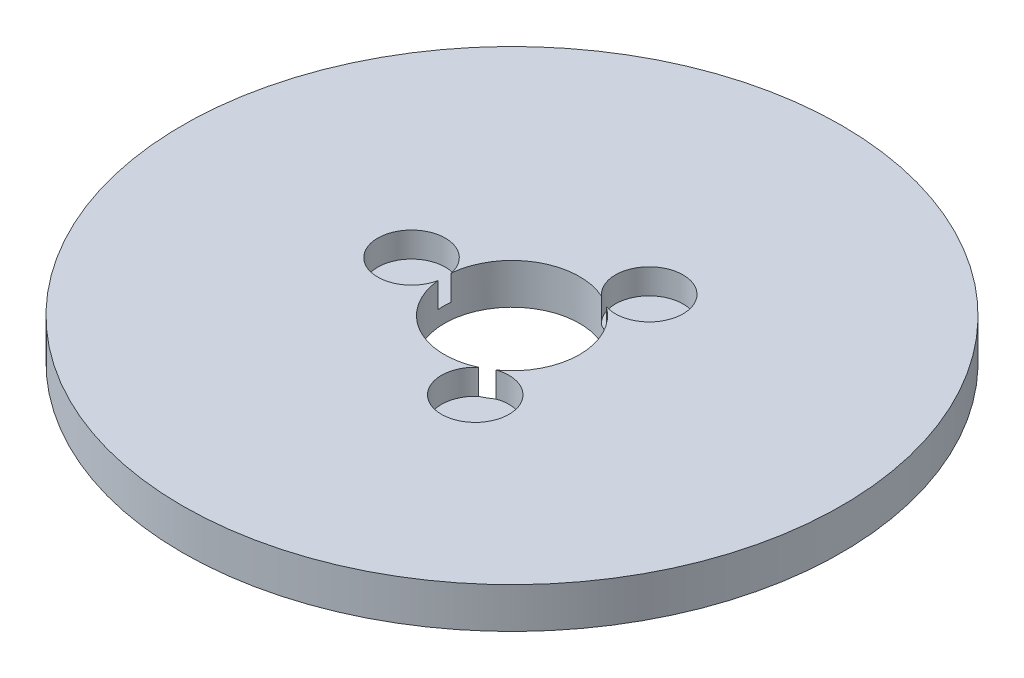
ISO-10303-21;
HEADER;
FILE_DESCRIPTION(('STEP AP214'),'2;1');
FILE_NAME('part.step','',(''),(''),'','','');
FILE_SCHEMA(('AUTOMOTIVE_DESIGN { 1 0 10303 214 1 1 1 1 }'));
ENDSEC;
DATA;
#1=APPLICATION_CONTEXT('core data for automotive mechanical design processes');
#2=APPLICATION_PROTOCOL_DEFINITION('international standard','automotive_design',2000,#1);
#3=PRODUCT_CONTEXT('',#1,'mechanical');
#4=PRODUCT('Part','Part','',(#3));
#5=PRODUCT_RELATED_PRODUCT_CATEGORY('part','',(#4));
#6=PRODUCT_DEFINITION_FORMATION('','',#4);
#7=PRODUCT_DEFINITION_CONTEXT('part definition',#1,'design');
#8=PRODUCT_DEFINITION('design','',#6,#7);
#9=PRODUCT_DEFINITION_SHAPE('','',#8);
#10=(LENGTH_UNIT() NAMED_UNIT(*) SI_UNIT(.MILLI.,.METRE.));
#11=(NAMED_UNIT(*) PLANE_ANGLE_UNIT() SI_UNIT($,.RADIAN.));
#12=(NAMED_UNIT(*) SI_UNIT($,.STERADIAN.) SOLID_ANGLE_UNIT());
#13=UNCERTAINTY_MEASURE_WITH_UNIT(LENGTH_MEASURE(1.E-05),#10,'distance_accuracy_value','');
#14=(GEOMETRIC_REPRESENTATION_CONTEXT(3) GLOBAL_UNCERTAINTY_ASSIGNED_CONTEXT((#13)) GLOBAL_UNIT_ASSIGNED_CONTEXT((#10,
#11,#12)) REPRESENTATION_CONTEXT('',''));
#15=CARTESIAN_POINT('',(0.,0.,0.));
#16=DIRECTION('',(0.,0.,1.));
#17=DIRECTION('',(1.,0.,0.));
#18=AXIS2_PLACEMENT_3D('',#15,#16,#17);
#19=CARTESIAN_POINT('',(0.,12.,0.));
#20=DIRECTION('',(0.,-1.,0.));
#21=DIRECTION('',(0.,0.,-1.));
#22=AXIS2_PLACEMENT_3D('',#19,#20,#21);
#23=CYLINDRICAL_SURFACE('',#22,97.5);
#24=CARTESIAN_POINT('',(0.,12.,0.));
#25=DIRECTION('',(0.,1.,0.));
#26=DIRECTION('',(0.,0.,1.));
#27=AXIS2_PLACEMENT_3D('',#24,#25,#26);
#28=CIRCLE('',#27,97.5);
#29=CARTESIAN_POINT('',(0.,12.,97.5));
#30=VERTEX_POINT('',#29);
#31=EDGE_CURVE('E126',#30,#30,#28,.T.);
#32=ORIENTED_EDGE('',*,*,#31,.F.);
#33=EDGE_LOOP('',(#32));
#34=FACE_BOUND('',#33,.T.);
#35=CARTESIAN_POINT('',(0.,0.,0.));
#36=DIRECTION('',(0.,1.,0.));
#37=DIRECTION('',(0.,0.,1.));
#38=AXIS2_PLACEMENT_3D('',#35,#36,#37);
#39=CIRCLE('',#38,97.5);
#40=CARTESIAN_POINT('',(0.,0.,97.5));
#41=VERTEX_POINT('',#40);
#42=EDGE_CURVE('E124',#41,#41,#39,.T.);
#43=ORIENTED_EDGE('',*,*,#42,.T.);
#44=EDGE_LOOP('',(#43));
#45=FACE_BOUND('',#44,.T.);
#46=ADVANCED_FACE('F39',(#34,#45),#23,.T.);
#47=CARTESIAN_POINT('',(0.,12.,0.));
#48=DIRECTION('',(0.,1.,0.));
#49=DIRECTION('',(0.,0.,1.));
#50=AXIS2_PLACEMENT_3D('',#47,#48,#49);
#51=PLANE('',#50);
#52=CARTESIAN_POINT('',(14.8614211598295,12.,25.7407365215036));
#53=DIRECTION('',(0.,1.,0.));
#54=DIRECTION('',(0.866025403784436,0.,-0.500000000000004));
#55=AXIS2_PLACEMENT_3D('',#52,#53,#54);
#56=CIRCLE('',#55,10.);
#57=CARTESIAN_POINT('',(8.29501281416073,12.,18.1987022178206));
#58=VERTEX_POINT('',#57);
#59=CARTESIAN_POINT('',(11.6130320294607,12.,16.2830429306908));
#60=VERTEX_POINT('',#59);
#61=EDGE_CURVE('E147',#58,#60,#56,.T.);
#62=ORIENTED_EDGE('',*,*,#61,.F.);
#63=CARTESIAN_POINT('',(0.,12.,0.));
#64=DIRECTION('',(0.,1.,0.));
#65=DIRECTION('',(0.,0.,1.));
#66=AXIS2_PLACEMENT_3D('',#63,#64,#65);
#67=CIRCLE('',#66,20.);
#68=CARTESIAN_POINT('',(-19.9080448436212,12.,1.91565928712979));
#69=VERTEX_POINT('',#68);
#70=EDGE_CURVE('E118',#69,#58,#67,.T.);
#71=ORIENTED_EDGE('',*,*,#70,.F.);
#72=CARTESIAN_POINT('',(-29.7228423196588,12.,0.));
#73=DIRECTION('',(0.,1.,0.));
#74=DIRECTION('',(0.,0.,1.));
#75=AXIS2_PLACEMENT_3D('',#72,#73,#74);
#76=CIRCLE('',#75,10.);
#77=CARTESIAN_POINT('',(-19.9080448436212,12.,-1.91565928712979));
#78=VERTEX_POINT('',#77);
#79=EDGE_CURVE('E113',#78,#69,#76,.T.);
#80=ORIENTED_EDGE('',*,*,#79,.F.);
#81=CARTESIAN_POINT('',(8.29501281416044,12.,-18.1987022178208));
#82=VERTEX_POINT('',#81);
#83=EDGE_CURVE('E106',#82,#78,#67,.T.);
#84=ORIENTED_EDGE('',*,*,#83,.F.);
#85=CARTESIAN_POINT('',(14.8614211598292,12.,-25.7407365215038));
#86=DIRECTION('',(0.,1.,0.));
#87=DIRECTION('',(-0.866025403784443,0.,-0.499999999999992));
#88=AXIS2_PLACEMENT_3D('',#85,#86,#87);
#89=CIRCLE('',#88,10.);
#90=CARTESIAN_POINT('',(11.6130320294605,12.,-16.283042930691));
#91=VERTEX_POINT('',#90);
#92=EDGE_CURVE('E90',#91,#82,#89,.T.);
#93=ORIENTED_EDGE('',*,*,#92,.F.);
#94=EDGE_CURVE('E116',#60,#91,#67,.T.);
#95=ORIENTED_EDGE('',*,*,#94,.F.);
#96=EDGE_LOOP('',(#62,#71,#80,#84,#93,#95));
#97=FACE_BOUND('',#96,.T.);
#98=ORIENTED_EDGE('',*,*,#31,.T.);
#99=EDGE_LOOP('',(#98));
#100=FACE_BOUND('',#99,.T.);
#101=ADVANCED_FACE('F115',(#97,#100),#51,.T.);
#102=CARTESIAN_POINT('',(0.,0.,0.));
#103=DIRECTION('',(0.,1.,0.));
#104=DIRECTION('',(0.,0.,1.));
#105=AXIS2_PLACEMENT_3D('',#102,#103,#104);
#106=PLANE('',#105);
#107=CARTESIAN_POINT('',(0.,0.,0.));
#108=DIRECTION('',(0.,1.,0.));
#109=DIRECTION('',(0.,0.,1.));
#110=AXIS2_PLACEMENT_3D('',#107,#108,#109);
#111=CIRCLE('',#110,20.);
#112=CARTESIAN_POINT('',(0.,0.,20.));
#113=VERTEX_POINT('',#112);
#114=EDGE_CURVE('E120',#113,#113,#111,.T.);
#115=ORIENTED_EDGE('',*,*,#114,.T.);
#116=EDGE_LOOP('',(#115));
#117=FACE_BOUND('',#116,.T.);
#118=ORIENTED_EDGE('',*,*,#42,.F.);
#119=EDGE_LOOP('',(#118));
#120=FACE_BOUND('',#119,.T.);
#121=ADVANCED_FACE('F164',(#117,#120),#106,.F.);
#122=CARTESIAN_POINT('',(0.,12.,0.));
#123=DIRECTION('',(0.,-1.,0.));
#124=DIRECTION('',(0.,0.,-1.));
#125=AXIS2_PLACEMENT_3D('',#122,#123,#124);
#126=CYLINDRICAL_SURFACE('',#125,20.);
#127=DIRECTION('',(0.,1.,0.));
#128=VECTOR('',#127,1.);
#129=CARTESIAN_POINT('',(8.29501281416073,8.27598889064091,18.1987022178206));
#130=LINE('',#129,#128);
#131=CARTESIAN_POINT('',(8.29501281416073,4.55197778128182,18.1987022178206));
#132=VERTEX_POINT('',#131);
#133=EDGE_CURVE('E11',#132,#58,#130,.T.);
#134=ORIENTED_EDGE('',*,*,#133,.F.);
#135=CARTESIAN_POINT('',(0.,4.55197778128182,0.));
#136=DIRECTION('',(0.,1.,0.));
#137=DIRECTION('',(0.,0.,1.));
#138=AXIS2_PLACEMENT_3D('',#135,#136,#137);
#139=CIRCLE('',#138,20.);
#140=CARTESIAN_POINT('',(11.6130320294607,4.55197778128182,16.2830429306908));
#141=VERTEX_POINT('',#140);
#142=EDGE_CURVE('E144',#132,#141,#139,.T.);
#143=ORIENTED_EDGE('',*,*,#142,.T.);
#144=DIRECTION('',(0.,1.,0.));
#145=VECTOR('',#144,1.);
#146=CARTESIAN_POINT('',(11.6130320294607,8.27598889064091,16.2830429306908));
#147=LINE('',#146,#145);
#148=EDGE_CURVE('E46',#60,#141,#147,.F.);
#149=ORIENTED_EDGE('',*,*,#148,.F.);
#150=ORIENTED_EDGE('',*,*,#94,.T.);
#151=DIRECTION('',(0.,1.,0.));
#152=VECTOR('',#151,1.);
#153=CARTESIAN_POINT('',(11.6130320294605,8.27598889064091,-16.283042930691));
#154=LINE('',#153,#152);
#155=CARTESIAN_POINT('',(11.6130320294605,4.55197778128182,-16.283042930691));
#156=VERTEX_POINT('',#155);
#157=EDGE_CURVE('E92',#156,#91,#154,.T.);
#158=ORIENTED_EDGE('',*,*,#157,.F.);
#159=CARTESIAN_POINT('',(0.,4.55197778128182,0.));
#160=DIRECTION('',(0.,1.,0.));
#161=DIRECTION('',(0.,0.,1.));
#162=AXIS2_PLACEMENT_3D('',#159,#160,#161);
#163=CIRCLE('',#162,20.);
#164=CARTESIAN_POINT('',(8.29501281416044,4.55197778128182,-18.1987022178208));
#165=VERTEX_POINT('',#164);
#166=EDGE_CURVE('E107',#156,#165,#163,.T.);
#167=ORIENTED_EDGE('',*,*,#166,.T.);
#168=DIRECTION('',(0.,1.,0.));
#169=VECTOR('',#168,1.);
#170=CARTESIAN_POINT('',(8.29501281416045,8.27598889064091,-18.1987022178208));
#171=LINE('',#170,#169);
#172=EDGE_CURVE('E95',#82,#165,#171,.F.);
#173=ORIENTED_EDGE('',*,*,#172,.F.);
#174=ORIENTED_EDGE('',*,*,#83,.T.);
#175=DIRECTION('',(0.,1.,0.));
#176=VECTOR('',#175,1.);
#177=CARTESIAN_POINT('',(-19.9080448436212,8.27598889064091,-1.9156592871298));
#178=LINE('',#177,#176);
#179=CARTESIAN_POINT('',(-19.9080448436212,4.55197778128182,-1.91565928712979));
#180=VERTEX_POINT('',#179);
#181=EDGE_CURVE('E143',#180,#78,#178,.T.);
#182=ORIENTED_EDGE('',*,*,#181,.F.);
#183=CARTESIAN_POINT('',(0.,4.55197778128182,0.));
#184=DIRECTION('',(0.,1.,0.));
#185=DIRECTION('',(0.,0.,1.));
#186=AXIS2_PLACEMENT_3D('',#183,#184,#185);
#187=CIRCLE('',#186,20.);
#188=CARTESIAN_POINT('',(-19.9080448436212,4.55197778128182,1.91565928712979));
#189=VERTEX_POINT('',#188);
#190=EDGE_CURVE('E132',#180,#189,#187,.T.);
#191=ORIENTED_EDGE('',*,*,#190,.T.);
#192=DIRECTION('',(0.,1.,0.));
#193=VECTOR('',#192,1.);
#194=CARTESIAN_POINT('',(-19.9080448436212,8.27598889064091,1.9156592871298));
#195=LINE('',#194,#193);
#196=EDGE_CURVE('E137',#69,#189,#195,.F.);
#197=ORIENTED_EDGE('',*,*,#196,.F.);
#198=ORIENTED_EDGE('',*,*,#70,.T.);
#199=EDGE_LOOP('',(#134,#143,#149,#150,#158,#167,#173,#174,#182,#191,#197,#198));
#200=FACE_BOUND('',#199,.T.);
#201=ORIENTED_EDGE('',*,*,#114,.F.);
#202=EDGE_LOOP('',(#201));
#203=FACE_BOUND('',#202,.T.);
#204=ADVANCED_FACE('F103',(#200,#203),#126,.F.);
#205=CARTESIAN_POINT('',(-29.7228423196588,4.55197778128182,0.));
#206=DIRECTION('',(0.,1.,0.));
#207=DIRECTION('',(0.,0.,1.));
#208=AXIS2_PLACEMENT_3D('',#205,#206,#207);
#209=CYLINDRICAL_SURFACE('',#208,10.);
#210=ORIENTED_EDGE('',*,*,#181,.T.);
#211=ORIENTED_EDGE('',*,*,#79,.T.);
#212=ORIENTED_EDGE('',*,*,#196,.T.);
#213=CARTESIAN_POINT('',(-29.7228423196588,4.55197778128182,0.));
#214=DIRECTION('',(0.,1.,0.));
#215=DIRECTION('',(0.,0.,1.));
#216=AXIS2_PLACEMENT_3D('',#213,#214,#215);
#217=CIRCLE('',#216,10.);
#218=EDGE_CURVE('E121',#180,#189,#217,.T.);
#219=ORIENTED_EDGE('',*,*,#218,.F.);
#220=EDGE_LOOP('',(#210,#211,#212,#219));
#221=FACE_BOUND('',#220,.T.);
#222=ADVANCED_FACE('F174',(#221),#209,.F.);
#223=CARTESIAN_POINT('',(-29.7228423196588,4.55197778128182,0.));
#224=DIRECTION('',(0.,1.,0.));
#225=DIRECTION('',(0.,0.,1.));
#226=AXIS2_PLACEMENT_3D('',#223,#224,#225);
#227=PLANE('',#226);
#228=ORIENTED_EDGE('',*,*,#218,.T.);
#229=ORIENTED_EDGE('',*,*,#190,.F.);
#230=EDGE_LOOP('',(#228,#229));
#231=FACE_BOUND('',#230,.T.);
#232=ADVANCED_FACE('F177',(#231),#227,.T.);
#233=CARTESIAN_POINT('',(14.8614211598292,4.55197778128182,-25.7407365215038));
#234=DIRECTION('',(0.,1.,0.));
#235=DIRECTION('',(0.,0.,1.));
#236=AXIS2_PLACEMENT_3D('',#233,#234,#235);
#237=CYLINDRICAL_SURFACE('',#236,10.);
#238=ORIENTED_EDGE('',*,*,#157,.T.);
#239=ORIENTED_EDGE('',*,*,#92,.T.);
#240=ORIENTED_EDGE('',*,*,#172,.T.);
#241=CARTESIAN_POINT('',(14.8614211598292,4.55197778128182,-25.7407365215038));
#242=DIRECTION('',(0.,1.,0.));
#243=DIRECTION('',(-0.866025403784443,0.,-0.499999999999992));
#244=AXIS2_PLACEMENT_3D('',#241,#242,#243);
#245=CIRCLE('',#244,10.);
#246=EDGE_CURVE('E56',#156,#165,#245,.T.);
#247=ORIENTED_EDGE('',*,*,#246,.F.);
#248=EDGE_LOOP('',(#238,#239,#240,#247));
#249=FACE_BOUND('',#248,.T.);
#250=ADVANCED_FACE('F93',(#249),#237,.F.);
#251=CARTESIAN_POINT('',(14.8614211598292,4.55197778128182,-25.7407365215038));
#252=DIRECTION('',(0.,1.,0.));
#253=DIRECTION('',(-0.866025403784443,0.,-0.499999999999992));
#254=AXIS2_PLACEMENT_3D('',#251,#252,#253);
#255=PLANE('',#254);
#256=ORIENTED_EDGE('',*,*,#246,.T.);
#257=ORIENTED_EDGE('',*,*,#166,.F.);
#258=EDGE_LOOP('',(#256,#257));
#259=FACE_BOUND('',#258,.T.);
#260=ADVANCED_FACE('F160',(#259),#255,.T.);
#261=CARTESIAN_POINT('',(14.8614211598295,4.55197778128182,25.7407365215036));
#262=DIRECTION('',(0.,1.,0.));
#263=DIRECTION('',(0.,0.,1.));
#264=AXIS2_PLACEMENT_3D('',#261,#262,#263);
#265=CYLINDRICAL_SURFACE('',#264,10.);
#266=ORIENTED_EDGE('',*,*,#133,.T.);
#267=ORIENTED_EDGE('',*,*,#61,.T.);
#268=ORIENTED_EDGE('',*,*,#148,.T.);
#269=CARTESIAN_POINT('',(14.8614211598295,4.55197778128182,25.7407365215036));
#270=DIRECTION('',(0.,1.,0.));
#271=DIRECTION('',(0.866025403784436,0.,-0.500000000000004));
#272=AXIS2_PLACEMENT_3D('',#269,#270,#271);
#273=CIRCLE('',#272,10.);
#274=EDGE_CURVE('E55',#132,#141,#273,.T.);
#275=ORIENTED_EDGE('',*,*,#274,.F.);
#276=EDGE_LOOP('',(#266,#267,#268,#275));
#277=FACE_BOUND('',#276,.T.);
#278=ADVANCED_FACE('F149',(#277),#265,.F.);
#279=CARTESIAN_POINT('',(14.8614211598295,4.55197778128182,25.7407365215036));
#280=DIRECTION('',(0.,1.,0.));
#281=DIRECTION('',(0.866025403784436,0.,-0.500000000000004));
#282=AXIS2_PLACEMENT_3D('',#279,#280,#281);
#283=PLANE('',#282);
#284=ORIENTED_EDGE('',*,*,#274,.T.);
#285=ORIENTED_EDGE('',*,*,#142,.F.);
#286=EDGE_LOOP('',(#284,#285));
#287=FACE_BOUND('',#286,.T.);
#288=ADVANCED_FACE('F151',(#287),#283,.T.);
#289=CLOSED_SHELL('',(#46,#101,#121,#204,#222,#232,#250,#260,#278,#288));
#290=MANIFOLD_SOLID_BREP('B2',#289);
#291=ADVANCED_BREP_SHAPE_REPRESENTATION('',(#18,#290),#14);
#292=SHAPE_DEFINITION_REPRESENTATION(#9,#291);
ENDSEC;
END-ISO-10303-21;
